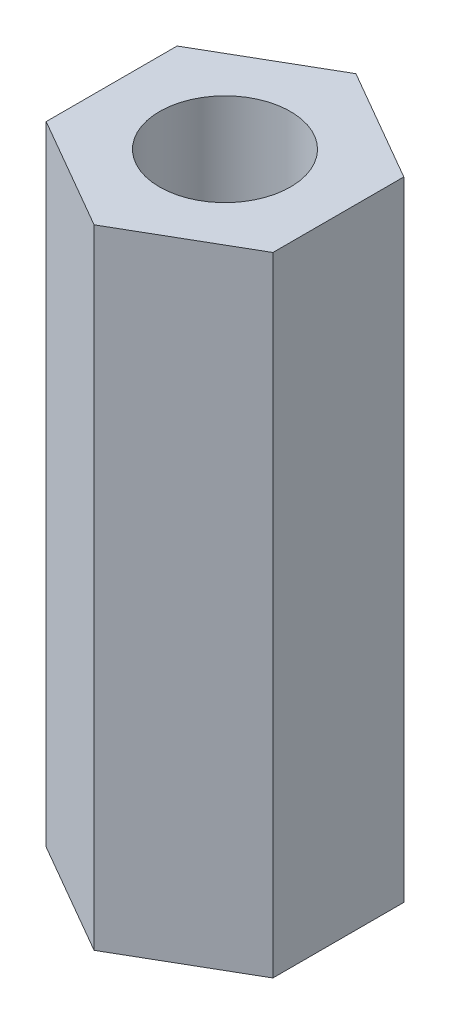
ISO-10303-21;
HEADER;
FILE_DESCRIPTION(('STEP AP214'),'2;1');
FILE_NAME('part.step','',(''),(''),'','','');
FILE_SCHEMA(('AUTOMOTIVE_DESIGN { 1 0 10303 214 1 1 1 1 }'));
ENDSEC;
DATA;
#1=APPLICATION_CONTEXT('core data for automotive mechanical design processes');
#2=APPLICATION_PROTOCOL_DEFINITION('international standard','automotive_design',2000,#1);
#3=PRODUCT_CONTEXT('',#1,'mechanical');
#4=PRODUCT('Part','Part','',(#3));
#5=PRODUCT_RELATED_PRODUCT_CATEGORY('part','',(#4));
#6=PRODUCT_DEFINITION_FORMATION('','',#4);
#7=PRODUCT_DEFINITION_CONTEXT('part definition',#1,'design');
#8=PRODUCT_DEFINITION('design','',#6,#7);
#9=PRODUCT_DEFINITION_SHAPE('','',#8);
#10=(LENGTH_UNIT() NAMED_UNIT(*) SI_UNIT(.MILLI.,.METRE.));
#11=(NAMED_UNIT(*) PLANE_ANGLE_UNIT() SI_UNIT($,.RADIAN.));
#12=(NAMED_UNIT(*) SI_UNIT($,.STERADIAN.) SOLID_ANGLE_UNIT());
#13=UNCERTAINTY_MEASURE_WITH_UNIT(LENGTH_MEASURE(1.E-05),#10,'distance_accuracy_value','');
#14=(GEOMETRIC_REPRESENTATION_CONTEXT(3) GLOBAL_UNCERTAINTY_ASSIGNED_CONTEXT((#13)) GLOBAL_UNIT_ASSIGNED_CONTEXT((#10,
#11,#12)) REPRESENTATION_CONTEXT('',''));
#15=CARTESIAN_POINT('',(0.,0.,0.));
#16=DIRECTION('',(0.,0.,1.));
#17=DIRECTION('',(1.,0.,0.));
#18=AXIS2_PLACEMENT_3D('',#15,#16,#17);
#19=CARTESIAN_POINT('',(0.,24.,-5.));
#20=DIRECTION('',(0.,1.,0.));
#21=DIRECTION('',(0.,0.,1.));
#22=AXIS2_PLACEMENT_3D('',#19,#20,#21);
#23=PLANE('',#22);
#24=DIRECTION('',(-0.866025403784439,0.,-0.5));
#25=VECTOR('',#24,1.);
#26=CARTESIAN_POINT('',(4.33012701892219,24.,-2.5));
#27=LINE('',#26,#25);
#28=CARTESIAN_POINT('',(4.33012701892219,24.,-2.5));
#29=VERTEX_POINT('',#28);
#30=CARTESIAN_POINT('',(0.,24.,-5.));
#31=VERTEX_POINT('',#30);
#32=EDGE_CURVE('E127',#29,#31,#27,.T.);
#33=ORIENTED_EDGE('',*,*,#32,.T.);
#34=DIRECTION('',(-0.866025403784439,0.,0.5));
#35=VECTOR('',#34,1.);
#36=CARTESIAN_POINT('',(0.,24.,-5.));
#37=LINE('',#36,#35);
#38=CARTESIAN_POINT('',(-4.33012701892219,24.,-2.5));
#39=VERTEX_POINT('',#38);
#40=EDGE_CURVE('E85',#31,#39,#37,.T.);
#41=ORIENTED_EDGE('',*,*,#40,.T.);
#42=DIRECTION('',(0.,0.,1.));
#43=VECTOR('',#42,1.);
#44=CARTESIAN_POINT('',(-4.33012701892219,24.,-2.5));
#45=LINE('',#44,#43);
#46=CARTESIAN_POINT('',(-4.33012701892219,24.,2.5));
#47=VERTEX_POINT('',#46);
#48=EDGE_CURVE('E98',#39,#47,#45,.T.);
#49=ORIENTED_EDGE('',*,*,#48,.T.);
#50=DIRECTION('',(0.866025403784439,0.,0.5));
#51=VECTOR('',#50,1.);
#52=CARTESIAN_POINT('',(-4.33012701892219,24.,2.5));
#53=LINE('',#52,#51);
#54=CARTESIAN_POINT('',(0.,24.,5.));
#55=VERTEX_POINT('',#54);
#56=EDGE_CURVE('E92',#47,#55,#53,.T.);
#57=ORIENTED_EDGE('',*,*,#56,.T.);
#58=DIRECTION('',(0.866025403784439,0.,-0.5));
#59=VECTOR('',#58,1.);
#60=CARTESIAN_POINT('',(0.,24.,5.));
#61=LINE('',#60,#59);
#62=CARTESIAN_POINT('',(4.33012701892219,24.,2.5));
#63=VERTEX_POINT('',#62);
#64=EDGE_CURVE('E96',#55,#63,#61,.T.);
#65=ORIENTED_EDGE('',*,*,#64,.T.);
#66=DIRECTION('',(0.,0.,-1.));
#67=VECTOR('',#66,1.);
#68=CARTESIAN_POINT('',(4.33012701892219,24.,2.5));
#69=LINE('',#68,#67);
#70=EDGE_CURVE('E48',#63,#29,#69,.T.);
#71=ORIENTED_EDGE('',*,*,#70,.T.);
#72=EDGE_LOOP('',(#33,#41,#49,#57,#65,#71));
#73=FACE_BOUND('',#72,.T.);
#74=CARTESIAN_POINT('',(0.,24.,0.));
#75=DIRECTION('',(0.,1.,0.));
#76=DIRECTION('',(0.,0.,1.));
#77=AXIS2_PLACEMENT_3D('',#74,#75,#76);
#78=CIRCLE('',#77,2.5);
#79=CARTESIAN_POINT('',(0.,24.,2.5));
#80=VERTEX_POINT('',#79);
#81=EDGE_CURVE('E120',#80,#80,#78,.T.);
#82=ORIENTED_EDGE('',*,*,#81,.F.);
#83=EDGE_LOOP('',(#82));
#84=FACE_BOUND('',#83,.T.);
#85=ADVANCED_FACE('F31',(#73,#84),#23,.T.);
#86=CARTESIAN_POINT('',(0.,0.,-5.));
#87=DIRECTION('',(0.,1.,0.));
#88=DIRECTION('',(0.,0.,1.));
#89=AXIS2_PLACEMENT_3D('',#86,#87,#88);
#90=PLANE('',#89);
#91=DIRECTION('',(-0.866025403784439,0.,-0.5));
#92=VECTOR('',#91,1.);
#93=CARTESIAN_POINT('',(4.33012701892219,0.,-2.5));
#94=LINE('',#93,#92);
#95=CARTESIAN_POINT('',(4.33012701892219,0.,-2.5));
#96=VERTEX_POINT('',#95);
#97=CARTESIAN_POINT('',(0.,0.,-5.));
#98=VERTEX_POINT('',#97);
#99=EDGE_CURVE('E116',#96,#98,#94,.T.);
#100=ORIENTED_EDGE('',*,*,#99,.F.);
#101=DIRECTION('',(0.,0.,-1.));
#102=VECTOR('',#101,1.);
#103=CARTESIAN_POINT('',(4.33012701892219,0.,2.5));
#104=LINE('',#103,#102);
#105=CARTESIAN_POINT('',(4.33012701892219,0.,2.5));
#106=VERTEX_POINT('',#105);
#107=EDGE_CURVE('E77',#106,#96,#104,.T.);
#108=ORIENTED_EDGE('',*,*,#107,.F.);
#109=DIRECTION('',(0.866025403784439,0.,-0.5));
#110=VECTOR('',#109,1.);
#111=CARTESIAN_POINT('',(0.,0.,5.));
#112=LINE('',#111,#110);
#113=CARTESIAN_POINT('',(0.,0.,5.));
#114=VERTEX_POINT('',#113);
#115=EDGE_CURVE('E71',#114,#106,#112,.T.);
#116=ORIENTED_EDGE('',*,*,#115,.F.);
#117=DIRECTION('',(0.866025403784439,0.,0.5));
#118=VECTOR('',#117,1.);
#119=CARTESIAN_POINT('',(-4.33012701892219,0.,2.5));
#120=LINE('',#119,#118);
#121=CARTESIAN_POINT('',(-4.33012701892219,0.,2.5));
#122=VERTEX_POINT('',#121);
#123=EDGE_CURVE('E106',#122,#114,#120,.T.);
#124=ORIENTED_EDGE('',*,*,#123,.F.);
#125=DIRECTION('',(0.,0.,1.));
#126=VECTOR('',#125,1.);
#127=CARTESIAN_POINT('',(-4.33012701892219,0.,-2.5));
#128=LINE('',#127,#126);
#129=CARTESIAN_POINT('',(-4.33012701892219,0.,-2.5));
#130=VERTEX_POINT('',#129);
#131=EDGE_CURVE('E122',#130,#122,#128,.T.);
#132=ORIENTED_EDGE('',*,*,#131,.F.);
#133=DIRECTION('',(-0.866025403784439,0.,0.5));
#134=VECTOR('',#133,1.);
#135=CARTESIAN_POINT('',(0.,0.,-5.));
#136=LINE('',#135,#134);
#137=EDGE_CURVE('E119',#98,#130,#136,.T.);
#138=ORIENTED_EDGE('',*,*,#137,.F.);
#139=EDGE_LOOP('',(#100,#108,#116,#124,#132,#138));
#140=FACE_BOUND('',#139,.T.);
#141=CARTESIAN_POINT('',(0.,0.,0.));
#142=DIRECTION('',(0.,1.,0.));
#143=DIRECTION('',(0.,0.,1.));
#144=AXIS2_PLACEMENT_3D('',#141,#142,#143);
#145=CIRCLE('',#144,2.5);
#146=CARTESIAN_POINT('',(0.,0.,2.5));
#147=VERTEX_POINT('',#146);
#148=EDGE_CURVE('E220',#147,#147,#145,.T.);
#149=ORIENTED_EDGE('',*,*,#148,.T.);
#150=EDGE_LOOP('',(#149));
#151=FACE_BOUND('',#150,.T.);
#152=ADVANCED_FACE('F136',(#140,#151),#90,.F.);
#153=CARTESIAN_POINT('',(4.33012701892219,24.,-2.5));
#154=DIRECTION('',(-0.5,0.,0.866025403784439));
#155=DIRECTION('',(0.866025403784439,0.,0.5));
#156=AXIS2_PLACEMENT_3D('',#153,#154,#155);
#157=PLANE('',#156);
#158=ORIENTED_EDGE('',*,*,#99,.T.);
#159=DIRECTION('',(0.,-1.,0.));
#160=VECTOR('',#159,1.);
#161=CARTESIAN_POINT('',(0.,24.,-5.));
#162=LINE('',#161,#160);
#163=EDGE_CURVE('E11',#31,#98,#162,.T.);
#164=ORIENTED_EDGE('',*,*,#163,.F.);
#165=ORIENTED_EDGE('',*,*,#32,.F.);
#166=DIRECTION('',(0.,-1.,0.));
#167=VECTOR('',#166,1.);
#168=CARTESIAN_POINT('',(4.33012701892219,24.,-2.5));
#169=LINE('',#168,#167);
#170=EDGE_CURVE('E112',#29,#96,#169,.T.);
#171=ORIENTED_EDGE('',*,*,#170,.T.);
#172=EDGE_LOOP('',(#158,#164,#165,#171));
#173=FACE_BOUND('',#172,.T.);
#174=ADVANCED_FACE('F33',(#173),#157,.F.);
#175=CARTESIAN_POINT('',(0.,24.,-5.));
#176=DIRECTION('',(0.5,0.,0.866025403784439));
#177=DIRECTION('',(0.866025403784439,0.,-0.5));
#178=AXIS2_PLACEMENT_3D('',#175,#176,#177);
#179=PLANE('',#178);
#180=ORIENTED_EDGE('',*,*,#137,.T.);
#181=DIRECTION('',(0.,-1.,0.));
#182=VECTOR('',#181,1.);
#183=CARTESIAN_POINT('',(-4.33012701892219,24.,-2.5));
#184=LINE('',#183,#182);
#185=EDGE_CURVE('E40',#39,#130,#184,.T.);
#186=ORIENTED_EDGE('',*,*,#185,.F.);
#187=ORIENTED_EDGE('',*,*,#40,.F.);
#188=ORIENTED_EDGE('',*,*,#163,.T.);
#189=EDGE_LOOP('',(#180,#186,#187,#188));
#190=FACE_BOUND('',#189,.T.);
#191=ADVANCED_FACE('F161',(#190),#179,.F.);
#192=CARTESIAN_POINT('',(-4.33012701892219,24.,-2.5));
#193=DIRECTION('',(1.,0.,0.));
#194=DIRECTION('',(0.,0.,-1.));
#195=AXIS2_PLACEMENT_3D('',#192,#193,#194);
#196=PLANE('',#195);
#197=ORIENTED_EDGE('',*,*,#131,.T.);
#198=DIRECTION('',(0.,-1.,0.));
#199=VECTOR('',#198,1.);
#200=CARTESIAN_POINT('',(-4.33012701892219,24.,2.5));
#201=LINE('',#200,#199);
#202=EDGE_CURVE('E107',#47,#122,#201,.T.);
#203=ORIENTED_EDGE('',*,*,#202,.F.);
#204=ORIENTED_EDGE('',*,*,#48,.F.);
#205=ORIENTED_EDGE('',*,*,#185,.T.);
#206=EDGE_LOOP('',(#197,#203,#204,#205));
#207=FACE_BOUND('',#206,.T.);
#208=ADVANCED_FACE('F133',(#207),#196,.F.);
#209=CARTESIAN_POINT('',(-4.33012701892219,24.,2.5));
#210=DIRECTION('',(0.5,0.,-0.866025403784439));
#211=DIRECTION('',(-0.866025403784439,0.,-0.5));
#212=AXIS2_PLACEMENT_3D('',#209,#210,#211);
#213=PLANE('',#212);
#214=ORIENTED_EDGE('',*,*,#123,.T.);
#215=DIRECTION('',(0.,-1.,0.));
#216=VECTOR('',#215,1.);
#217=CARTESIAN_POINT('',(0.,24.,5.));
#218=LINE('',#217,#216);
#219=EDGE_CURVE('E103',#55,#114,#218,.T.);
#220=ORIENTED_EDGE('',*,*,#219,.F.);
#221=ORIENTED_EDGE('',*,*,#56,.F.);
#222=ORIENTED_EDGE('',*,*,#202,.T.);
#223=EDGE_LOOP('',(#214,#220,#221,#222));
#224=FACE_BOUND('',#223,.T.);
#225=ADVANCED_FACE('F104',(#224),#213,.F.);
#226=CARTESIAN_POINT('',(0.,24.,5.));
#227=DIRECTION('',(-0.5,0.,-0.866025403784439));
#228=DIRECTION('',(-0.866025403784439,0.,0.5));
#229=AXIS2_PLACEMENT_3D('',#226,#227,#228);
#230=PLANE('',#229);
#231=ORIENTED_EDGE('',*,*,#115,.T.);
#232=DIRECTION('',(0.,-1.,0.));
#233=VECTOR('',#232,1.);
#234=CARTESIAN_POINT('',(4.33012701892219,24.,2.5));
#235=LINE('',#234,#233);
#236=EDGE_CURVE('E108',#63,#106,#235,.T.);
#237=ORIENTED_EDGE('',*,*,#236,.F.);
#238=ORIENTED_EDGE('',*,*,#64,.F.);
#239=ORIENTED_EDGE('',*,*,#219,.T.);
#240=EDGE_LOOP('',(#231,#237,#238,#239));
#241=FACE_BOUND('',#240,.T.);
#242=ADVANCED_FACE('F110',(#241),#230,.F.);
#243=CARTESIAN_POINT('',(4.33012701892219,24.,2.5));
#244=DIRECTION('',(-1.,0.,0.));
#245=DIRECTION('',(0.,0.,1.));
#246=AXIS2_PLACEMENT_3D('',#243,#244,#245);
#247=PLANE('',#246);
#248=ORIENTED_EDGE('',*,*,#107,.T.);
#249=ORIENTED_EDGE('',*,*,#170,.F.);
#250=ORIENTED_EDGE('',*,*,#70,.F.);
#251=ORIENTED_EDGE('',*,*,#236,.T.);
#252=EDGE_LOOP('',(#248,#249,#250,#251));
#253=FACE_BOUND('',#252,.T.);
#254=ADVANCED_FACE('F141',(#253),#247,.F.);
#255=CARTESIAN_POINT('',(0.,24.,0.));
#256=DIRECTION('',(0.,-1.,0.));
#257=DIRECTION('',(0.,0.,-1.));
#258=AXIS2_PLACEMENT_3D('',#255,#256,#257);
#259=CYLINDRICAL_SURFACE('',#258,2.5);
#260=ORIENTED_EDGE('',*,*,#81,.T.);
#261=EDGE_LOOP('',(#260));
#262=FACE_BOUND('',#261,.T.);
#263=ORIENTED_EDGE('',*,*,#148,.F.);
#264=EDGE_LOOP('',(#263));
#265=FACE_BOUND('',#264,.T.);
#266=ADVANCED_FACE('F143',(#262,#265),#259,.F.);
#267=CLOSED_SHELL('',(#85,#152,#174,#191,#208,#225,#242,#254,#266));
#268=MANIFOLD_SOLID_BREP('B2',#267);
#269=ADVANCED_BREP_SHAPE_REPRESENTATION('',(#18,#268),#14);
#270=SHAPE_DEFINITION_REPRESENTATION(#9,#269);
ENDSEC;
END-ISO-10303-21;
